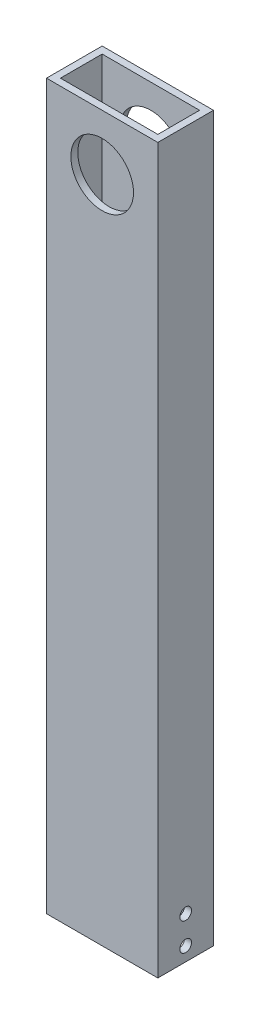
ISO-10303-21;
HEADER;
FILE_DESCRIPTION(('STEP AP214'),'2;1');
FILE_NAME('part.step','',(''),(''),'','','');
FILE_SCHEMA(('AUTOMOTIVE_DESIGN { 1 0 10303 214 1 1 1 1 }'));
ENDSEC;
DATA;
#1=APPLICATION_CONTEXT('core data for automotive mechanical design processes');
#2=APPLICATION_PROTOCOL_DEFINITION('international standard','automotive_design',2000,#1);
#3=PRODUCT_CONTEXT('',#1,'mechanical');
#4=PRODUCT('Part','Part','',(#3));
#5=PRODUCT_RELATED_PRODUCT_CATEGORY('part','',(#4));
#6=PRODUCT_DEFINITION_FORMATION('','',#4);
#7=PRODUCT_DEFINITION_CONTEXT('part definition',#1,'design');
#8=PRODUCT_DEFINITION('design','',#6,#7);
#9=PRODUCT_DEFINITION_SHAPE('','',#8);
#10=(LENGTH_UNIT() NAMED_UNIT(*) SI_UNIT(.MILLI.,.METRE.));
#11=(NAMED_UNIT(*) PLANE_ANGLE_UNIT() SI_UNIT($,.RADIAN.));
#12=(NAMED_UNIT(*) SI_UNIT($,.STERADIAN.) SOLID_ANGLE_UNIT());
#13=UNCERTAINTY_MEASURE_WITH_UNIT(LENGTH_MEASURE(1.E-05),#10,'distance_accuracy_value','');
#14=(GEOMETRIC_REPRESENTATION_CONTEXT(3) GLOBAL_UNCERTAINTY_ASSIGNED_CONTEXT((#13)) GLOBAL_UNIT_ASSIGNED_CONTEXT((#10,
#11,#12)) REPRESENTATION_CONTEXT('',''));
#15=CARTESIAN_POINT('',(0.,0.,0.));
#16=DIRECTION('',(0.,0.,1.));
#17=DIRECTION('',(1.,0.,0.));
#18=AXIS2_PLACEMENT_3D('',#15,#16,#17);
#19=CARTESIAN_POINT('',(0.,330.2,0.));
#20=DIRECTION('',(0.,-1.,0.));
#21=DIRECTION('',(0.,0.,-1.));
#22=AXIS2_PLACEMENT_3D('',#19,#20,#21);
#23=PLANE('',#22);
#24=DIRECTION('',(0.,0.,1.));
#25=VECTOR('',#24,1.);
#26=CARTESIAN_POINT('',(0.,330.2,0.));
#27=LINE('',#26,#25);
#28=CARTESIAN_POINT('',(0.,330.2,-25.4));
#29=VERTEX_POINT('',#28);
#30=CARTESIAN_POINT('',(0.,330.2,0.));
#31=VERTEX_POINT('',#30);
#32=EDGE_CURVE('E156',#29,#31,#27,.T.);
#33=ORIENTED_EDGE('',*,*,#32,.T.);
#34=DIRECTION('',(1.,0.,0.));
#35=VECTOR('',#34,1.);
#36=CARTESIAN_POINT('',(0.,330.2,0.));
#37=LINE('',#36,#35);
#38=CARTESIAN_POINT('',(50.8,330.2,0.));
#39=VERTEX_POINT('',#38);
#40=EDGE_CURVE('E160',#31,#39,#37,.T.);
#41=ORIENTED_EDGE('',*,*,#40,.T.);
#42=DIRECTION('',(0.,0.,-1.));
#43=VECTOR('',#42,1.);
#44=CARTESIAN_POINT('',(50.8,330.2,0.));
#45=LINE('',#44,#43);
#46=CARTESIAN_POINT('',(50.8,330.2,-25.4));
#47=VERTEX_POINT('',#46);
#48=EDGE_CURVE('E164',#39,#47,#45,.T.);
#49=ORIENTED_EDGE('',*,*,#48,.T.);
#50=DIRECTION('',(-1.,0.,0.));
#51=VECTOR('',#50,1.);
#52=CARTESIAN_POINT('',(0.,330.2,-25.4));
#53=LINE('',#52,#51);
#54=EDGE_CURVE('E167',#47,#29,#53,.T.);
#55=ORIENTED_EDGE('',*,*,#54,.T.);
#56=EDGE_LOOP('',(#33,#41,#49,#55));
#57=FACE_BOUND('',#56,.T.);
#58=DIRECTION('',(0.,0.,1.));
#59=VECTOR('',#58,1.);
#60=CARTESIAN_POINT('',(3.175,330.2,-3.175));
#61=LINE('',#60,#59);
#62=CARTESIAN_POINT('',(3.175,330.2,-22.225));
#63=VERTEX_POINT('',#62);
#64=CARTESIAN_POINT('',(3.175,330.2,-3.175));
#65=VERTEX_POINT('',#64);
#66=EDGE_CURVE('E106',#63,#65,#61,.T.);
#67=ORIENTED_EDGE('',*,*,#66,.F.);
#68=DIRECTION('',(-1.,0.,0.));
#69=VECTOR('',#68,1.);
#70=CARTESIAN_POINT('',(3.175,330.2,-22.225));
#71=LINE('',#70,#69);
#72=CARTESIAN_POINT('',(47.625,330.2,-22.225));
#73=VERTEX_POINT('',#72);
#74=EDGE_CURVE('E132',#73,#63,#71,.T.);
#75=ORIENTED_EDGE('',*,*,#74,.F.);
#76=DIRECTION('',(0.,0.,-1.));
#77=VECTOR('',#76,1.);
#78=CARTESIAN_POINT('',(47.625,330.2,-3.175));
#79=LINE('',#78,#77);
#80=CARTESIAN_POINT('',(47.625,330.2,-3.175));
#81=VERTEX_POINT('',#80);
#82=EDGE_CURVE('E128',#81,#73,#79,.T.);
#83=ORIENTED_EDGE('',*,*,#82,.F.);
#84=DIRECTION('',(1.,0.,0.));
#85=VECTOR('',#84,1.);
#86=CARTESIAN_POINT('',(3.175,330.2,-3.175));
#87=LINE('',#86,#85);
#88=EDGE_CURVE('E115',#65,#81,#87,.T.);
#89=ORIENTED_EDGE('',*,*,#88,.F.);
#90=EDGE_LOOP('',(#67,#75,#83,#89));
#91=FACE_BOUND('',#90,.T.);
#92=ADVANCED_FACE('F39',(#57,#91),#23,.F.);
#93=CARTESIAN_POINT('',(0.,0.,0.));
#94=DIRECTION('',(0.,-1.,0.));
#95=DIRECTION('',(0.,0.,-1.));
#96=AXIS2_PLACEMENT_3D('',#93,#94,#95);
#97=PLANE('',#96);
#98=DIRECTION('',(0.,0.,1.));
#99=VECTOR('',#98,1.);
#100=CARTESIAN_POINT('',(0.,0.,0.));
#101=LINE('',#100,#99);
#102=CARTESIAN_POINT('',(0.,0.,-25.4));
#103=VERTEX_POINT('',#102);
#104=CARTESIAN_POINT('',(0.,0.,0.));
#105=VERTEX_POINT('',#104);
#106=EDGE_CURVE('E124',#103,#105,#101,.T.);
#107=ORIENTED_EDGE('',*,*,#106,.F.);
#108=DIRECTION('',(-1.,0.,0.));
#109=VECTOR('',#108,1.);
#110=CARTESIAN_POINT('',(0.,0.,-25.4));
#111=LINE('',#110,#109);
#112=CARTESIAN_POINT('',(50.8,0.,-25.4));
#113=VERTEX_POINT('',#112);
#114=EDGE_CURVE('E161',#113,#103,#111,.T.);
#115=ORIENTED_EDGE('',*,*,#114,.F.);
#116=DIRECTION('',(0.,0.,-1.));
#117=VECTOR('',#116,1.);
#118=CARTESIAN_POINT('',(50.8,0.,0.));
#119=LINE('',#118,#117);
#120=CARTESIAN_POINT('',(50.8,0.,0.));
#121=VERTEX_POINT('',#120);
#122=EDGE_CURVE('E177',#121,#113,#119,.T.);
#123=ORIENTED_EDGE('',*,*,#122,.F.);
#124=DIRECTION('',(1.,0.,0.));
#125=VECTOR('',#124,1.);
#126=CARTESIAN_POINT('',(0.,0.,0.));
#127=LINE('',#126,#125);
#128=EDGE_CURVE('E174',#105,#121,#127,.T.);
#129=ORIENTED_EDGE('',*,*,#128,.F.);
#130=EDGE_LOOP('',(#107,#115,#123,#129));
#131=FACE_BOUND('',#130,.T.);
#132=DIRECTION('',(-1.,0.,0.));
#133=VECTOR('',#132,1.);
#134=CARTESIAN_POINT('',(3.175,0.,-22.225));
#135=LINE('',#134,#133);
#136=CARTESIAN_POINT('',(47.625,0.,-22.225));
#137=VERTEX_POINT('',#136);
#138=CARTESIAN_POINT('',(3.175,0.,-22.225));
#139=VERTEX_POINT('',#138);
#140=EDGE_CURVE('E116',#137,#139,#135,.T.);
#141=ORIENTED_EDGE('',*,*,#140,.T.);
#142=DIRECTION('',(0.,0.,1.));
#143=VECTOR('',#142,1.);
#144=CARTESIAN_POINT('',(3.175,0.,-3.175));
#145=LINE('',#144,#143);
#146=CARTESIAN_POINT('',(3.175,0.,-3.175));
#147=VERTEX_POINT('',#146);
#148=EDGE_CURVE('E64',#139,#147,#145,.T.);
#149=ORIENTED_EDGE('',*,*,#148,.T.);
#150=DIRECTION('',(1.,0.,0.));
#151=VECTOR('',#150,1.);
#152=CARTESIAN_POINT('',(3.175,0.,-3.175));
#153=LINE('',#152,#151);
#154=CARTESIAN_POINT('',(47.625,0.,-3.175));
#155=VERTEX_POINT('',#154);
#156=EDGE_CURVE('E122',#147,#155,#153,.T.);
#157=ORIENTED_EDGE('',*,*,#156,.T.);
#158=DIRECTION('',(0.,0.,-1.));
#159=VECTOR('',#158,1.);
#160=CARTESIAN_POINT('',(47.625,0.,-3.175));
#161=LINE('',#160,#159);
#162=EDGE_CURVE('E143',#155,#137,#161,.T.);
#163=ORIENTED_EDGE('',*,*,#162,.T.);
#164=EDGE_LOOP('',(#141,#149,#157,#163));
#165=FACE_BOUND('',#164,.T.);
#166=ADVANCED_FACE('F201',(#131,#165),#97,.T.);
#167=CARTESIAN_POINT('',(0.,330.2,0.));
#168=DIRECTION('',(1.,0.,0.));
#169=DIRECTION('',(0.,0.,-1.));
#170=AXIS2_PLACEMENT_3D('',#167,#168,#169);
#171=PLANE('',#170);
#172=ORIENTED_EDGE('',*,*,#106,.T.);
#173=DIRECTION('',(0.,-1.,0.));
#174=VECTOR('',#173,1.);
#175=CARTESIAN_POINT('',(0.,330.2,0.));
#176=LINE('',#175,#174);
#177=EDGE_CURVE('E11',#31,#105,#176,.T.);
#178=ORIENTED_EDGE('',*,*,#177,.F.);
#179=ORIENTED_EDGE('',*,*,#32,.F.);
#180=DIRECTION('',(0.,-1.,0.));
#181=VECTOR('',#180,1.);
#182=CARTESIAN_POINT('',(0.,330.2,-25.4));
#183=LINE('',#182,#181);
#184=EDGE_CURVE('E170',#29,#103,#183,.T.);
#185=ORIENTED_EDGE('',*,*,#184,.T.);
#186=EDGE_LOOP('',(#172,#178,#179,#185));
#187=FACE_BOUND('',#186,.T.);
#188=ADVANCED_FACE('F41',(#187),#171,.F.);
#189=CARTESIAN_POINT('',(0.,330.2,0.));
#190=DIRECTION('',(0.,0.,-1.));
#191=DIRECTION('',(-1.,0.,0.));
#192=AXIS2_PLACEMENT_3D('',#189,#190,#191);
#193=PLANE('',#192);
#194=CARTESIAN_POINT('',(25.4,304.8,0.));
#195=DIRECTION('',(0.,0.,1.));
#196=DIRECTION('',(1.,0.,0.));
#197=AXIS2_PLACEMENT_3D('',#194,#195,#196);
#198=CIRCLE('',#197,14.2875);
#199=CARTESIAN_POINT('',(39.6875,304.8,0.));
#200=VERTEX_POINT('',#199);
#201=EDGE_CURVE('E240',#200,#200,#198,.T.);
#202=ORIENTED_EDGE('',*,*,#201,.F.);
#203=EDGE_LOOP('',(#202));
#204=FACE_BOUND('',#203,.T.);
#205=ORIENTED_EDGE('',*,*,#128,.T.);
#206=DIRECTION('',(0.,-1.,0.));
#207=VECTOR('',#206,1.);
#208=CARTESIAN_POINT('',(50.8,330.2,0.));
#209=LINE('',#208,#207);
#210=EDGE_CURVE('E49',#39,#121,#209,.T.);
#211=ORIENTED_EDGE('',*,*,#210,.F.);
#212=ORIENTED_EDGE('',*,*,#40,.F.);
#213=ORIENTED_EDGE('',*,*,#177,.T.);
#214=EDGE_LOOP('',(#205,#211,#212,#213));
#215=FACE_BOUND('',#214,.T.);
#216=ADVANCED_FACE('F211',(#204,#215),#193,.F.);
#217=CARTESIAN_POINT('',(50.8,330.2,0.));
#218=DIRECTION('',(-1.,0.,0.));
#219=DIRECTION('',(0.,0.,1.));
#220=AXIS2_PLACEMENT_3D('',#217,#218,#219);
#221=PLANE('',#220);
#222=CARTESIAN_POINT('',(50.8,19.05,-12.7));
#223=DIRECTION('',(1.,0.,0.));
#224=DIRECTION('',(0.,0.,-1.));
#225=AXIS2_PLACEMENT_3D('',#222,#223,#224);
#226=CIRCLE('',#225,2.667);
#227=CARTESIAN_POINT('',(50.8,19.05,-15.367));
#228=VERTEX_POINT('',#227);
#229=EDGE_CURVE('E284',#228,#228,#226,.T.);
#230=ORIENTED_EDGE('',*,*,#229,.F.);
#231=EDGE_LOOP('',(#230));
#232=FACE_BOUND('',#231,.T.);
#233=CARTESIAN_POINT('',(50.8,6.35,-12.7));
#234=DIRECTION('',(1.,0.,0.));
#235=DIRECTION('',(0.,0.,-1.));
#236=AXIS2_PLACEMENT_3D('',#233,#234,#235);
#237=CIRCLE('',#236,2.667);
#238=CARTESIAN_POINT('',(50.8,6.35,-15.367));
#239=VERTEX_POINT('',#238);
#240=EDGE_CURVE('E293',#239,#239,#237,.T.);
#241=ORIENTED_EDGE('',*,*,#240,.F.);
#242=EDGE_LOOP('',(#241));
#243=FACE_BOUND('',#242,.T.);
#244=ORIENTED_EDGE('',*,*,#122,.T.);
#245=DIRECTION('',(0.,-1.,0.));
#246=VECTOR('',#245,1.);
#247=CARTESIAN_POINT('',(50.8,330.2,-25.4));
#248=LINE('',#247,#246);
#249=EDGE_CURVE('E185',#47,#113,#248,.T.);
#250=ORIENTED_EDGE('',*,*,#249,.F.);
#251=ORIENTED_EDGE('',*,*,#48,.F.);
#252=ORIENTED_EDGE('',*,*,#210,.T.);
#253=EDGE_LOOP('',(#244,#250,#251,#252));
#254=FACE_BOUND('',#253,.T.);
#255=ADVANCED_FACE('F195',(#232,#243,#254),#221,.F.);
#256=CARTESIAN_POINT('',(0.,330.2,-25.4));
#257=DIRECTION('',(0.,0.,1.));
#258=DIRECTION('',(1.,0.,0.));
#259=AXIS2_PLACEMENT_3D('',#256,#257,#258);
#260=PLANE('',#259);
#261=CARTESIAN_POINT('',(25.4,304.8,-25.4));
#262=DIRECTION('',(0.,0.,1.));
#263=DIRECTION('',(1.,0.,0.));
#264=AXIS2_PLACEMENT_3D('',#261,#262,#263);
#265=CIRCLE('',#264,14.2875);
#266=CARTESIAN_POINT('',(39.6875,304.8,-25.4));
#267=VERTEX_POINT('',#266);
#268=EDGE_CURVE('E237',#267,#267,#265,.F.);
#269=ORIENTED_EDGE('',*,*,#268,.F.);
#270=EDGE_LOOP('',(#269));
#271=FACE_BOUND('',#270,.T.);
#272=ORIENTED_EDGE('',*,*,#114,.T.);
#273=ORIENTED_EDGE('',*,*,#184,.F.);
#274=ORIENTED_EDGE('',*,*,#54,.F.);
#275=ORIENTED_EDGE('',*,*,#249,.T.);
#276=EDGE_LOOP('',(#272,#273,#274,#275));
#277=FACE_BOUND('',#276,.T.);
#278=ADVANCED_FACE('F205',(#271,#277),#260,.F.);
#279=CARTESIAN_POINT('',(3.175,330.2,-3.175));
#280=DIRECTION('',(1.,0.,0.));
#281=DIRECTION('',(0.,0.,-1.));
#282=AXIS2_PLACEMENT_3D('',#279,#280,#281);
#283=PLANE('',#282);
#284=ORIENTED_EDGE('',*,*,#148,.F.);
#285=DIRECTION('',(0.,-1.,0.));
#286=VECTOR('',#285,1.);
#287=CARTESIAN_POINT('',(3.175,330.2,-22.225));
#288=LINE('',#287,#286);
#289=EDGE_CURVE('E110',#63,#139,#288,.T.);
#290=ORIENTED_EDGE('',*,*,#289,.F.);
#291=ORIENTED_EDGE('',*,*,#66,.T.);
#292=DIRECTION('',(0.,-1.,0.));
#293=VECTOR('',#292,1.);
#294=CARTESIAN_POINT('',(3.175,330.2,-3.175));
#295=LINE('',#294,#293);
#296=EDGE_CURVE('E109',#65,#147,#295,.T.);
#297=ORIENTED_EDGE('',*,*,#296,.T.);
#298=EDGE_LOOP('',(#284,#290,#291,#297));
#299=FACE_BOUND('',#298,.T.);
#300=ADVANCED_FACE('F108',(#299),#283,.T.);
#301=CARTESIAN_POINT('',(3.175,330.2,-3.175));
#302=DIRECTION('',(0.,0.,-1.));
#303=DIRECTION('',(-1.,0.,0.));
#304=AXIS2_PLACEMENT_3D('',#301,#302,#303);
#305=PLANE('',#304);
#306=CARTESIAN_POINT('',(25.4,304.8,-3.175));
#307=DIRECTION('',(0.,0.,-1.));
#308=DIRECTION('',(-1.,0.,0.));
#309=AXIS2_PLACEMENT_3D('',#306,#307,#308);
#310=CIRCLE('',#309,14.2875);
#311=CARTESIAN_POINT('',(11.1125,304.8,-3.175));
#312=VERTEX_POINT('',#311);
#313=EDGE_CURVE('E140',#312,#312,#310,.T.);
#314=ORIENTED_EDGE('',*,*,#313,.F.);
#315=EDGE_LOOP('',(#314));
#316=FACE_BOUND('',#315,.T.);
#317=ORIENTED_EDGE('',*,*,#156,.F.);
#318=ORIENTED_EDGE('',*,*,#296,.F.);
#319=ORIENTED_EDGE('',*,*,#88,.T.);
#320=DIRECTION('',(0.,-1.,0.));
#321=VECTOR('',#320,1.);
#322=CARTESIAN_POINT('',(47.625,330.2,-3.175));
#323=LINE('',#322,#321);
#324=EDGE_CURVE('E125',#81,#155,#323,.T.);
#325=ORIENTED_EDGE('',*,*,#324,.T.);
#326=EDGE_LOOP('',(#317,#318,#319,#325));
#327=FACE_BOUND('',#326,.T.);
#328=ADVANCED_FACE('F119',(#316,#327),#305,.T.);
#329=CARTESIAN_POINT('',(47.625,330.2,-3.175));
#330=DIRECTION('',(-1.,0.,0.));
#331=DIRECTION('',(0.,0.,1.));
#332=AXIS2_PLACEMENT_3D('',#329,#330,#331);
#333=PLANE('',#332);
#334=CARTESIAN_POINT('',(47.625,19.05,-12.7));
#335=DIRECTION('',(-1.,0.,0.));
#336=DIRECTION('',(0.,0.,1.));
#337=AXIS2_PLACEMENT_3D('',#334,#335,#336);
#338=CIRCLE('',#337,2.667);
#339=CARTESIAN_POINT('',(47.625,19.05,-10.033));
#340=VERTEX_POINT('',#339);
#341=EDGE_CURVE('E246',#340,#340,#338,.F.);
#342=ORIENTED_EDGE('',*,*,#341,.T.);
#343=EDGE_LOOP('',(#342));
#344=FACE_BOUND('',#343,.T.);
#345=CARTESIAN_POINT('',(47.625,6.35,-12.7));
#346=DIRECTION('',(-1.,0.,0.));
#347=DIRECTION('',(0.,0.,1.));
#348=AXIS2_PLACEMENT_3D('',#345,#346,#347);
#349=CIRCLE('',#348,2.667);
#350=CARTESIAN_POINT('',(47.625,6.35,-10.033));
#351=VERTEX_POINT('',#350);
#352=EDGE_CURVE('E290',#351,#351,#349,.F.);
#353=ORIENTED_EDGE('',*,*,#352,.T.);
#354=EDGE_LOOP('',(#353));
#355=FACE_BOUND('',#354,.T.);
#356=ORIENTED_EDGE('',*,*,#162,.F.);
#357=ORIENTED_EDGE('',*,*,#324,.F.);
#358=ORIENTED_EDGE('',*,*,#82,.T.);
#359=DIRECTION('',(0.,-1.,0.));
#360=VECTOR('',#359,1.);
#361=CARTESIAN_POINT('',(47.625,330.2,-22.225));
#362=LINE('',#361,#360);
#363=EDGE_CURVE('E56',#73,#137,#362,.T.);
#364=ORIENTED_EDGE('',*,*,#363,.T.);
#365=EDGE_LOOP('',(#356,#357,#358,#364));
#366=FACE_BOUND('',#365,.T.);
#367=ADVANCED_FACE('F257',(#344,#355,#366),#333,.T.);
#368=CARTESIAN_POINT('',(3.175,330.2,-22.225));
#369=DIRECTION('',(0.,0.,1.));
#370=DIRECTION('',(1.,0.,0.));
#371=AXIS2_PLACEMENT_3D('',#368,#369,#370);
#372=PLANE('',#371);
#373=CARTESIAN_POINT('',(25.4,304.8,-22.225));
#374=DIRECTION('',(0.,0.,1.));
#375=DIRECTION('',(1.,0.,0.));
#376=AXIS2_PLACEMENT_3D('',#373,#374,#375);
#377=CIRCLE('',#376,14.2875);
#378=CARTESIAN_POINT('',(39.6875,304.8,-22.225));
#379=VERTEX_POINT('',#378);
#380=EDGE_CURVE('E43',#379,#379,#377,.T.);
#381=ORIENTED_EDGE('',*,*,#380,.F.);
#382=EDGE_LOOP('',(#381));
#383=FACE_BOUND('',#382,.T.);
#384=ORIENTED_EDGE('',*,*,#140,.F.);
#385=ORIENTED_EDGE('',*,*,#363,.F.);
#386=ORIENTED_EDGE('',*,*,#74,.T.);
#387=ORIENTED_EDGE('',*,*,#289,.T.);
#388=EDGE_LOOP('',(#384,#385,#386,#387));
#389=FACE_BOUND('',#388,.T.);
#390=ADVANCED_FACE('F261',(#383,#389),#372,.T.);
#391=CARTESIAN_POINT('',(25.4,304.8,-65.8111525448112));
#392=DIRECTION('',(0.,0.,1.));
#393=DIRECTION('',(1.,0.,0.));
#394=AXIS2_PLACEMENT_3D('',#391,#392,#393);
#395=CYLINDRICAL_SURFACE('',#394,14.2875);
#396=ORIENTED_EDGE('',*,*,#380,.T.);
#397=EDGE_LOOP('',(#396));
#398=FACE_BOUND('',#397,.T.);
#399=ORIENTED_EDGE('',*,*,#268,.T.);
#400=EDGE_LOOP('',(#399));
#401=FACE_BOUND('',#400,.T.);
#402=ADVANCED_FACE('F267',(#398,#401),#395,.F.);
#403=ORIENTED_EDGE('',*,*,#313,.T.);
#404=EDGE_LOOP('',(#403));
#405=FACE_BOUND('',#404,.T.);
#406=ORIENTED_EDGE('',*,*,#201,.T.);
#407=EDGE_LOOP('',(#406));
#408=FACE_BOUND('',#407,.T.);
#409=ADVANCED_FACE('F253',(#405,#408),#395,.F.);
#410=CARTESIAN_POINT('',(40.0815848583019,6.35,-12.7));
#411=DIRECTION('',(1.,0.,0.));
#412=DIRECTION('',(0.,0.,-1.));
#413=AXIS2_PLACEMENT_3D('',#410,#411,#412);
#414=CYLINDRICAL_SURFACE('',#413,2.667);
#415=ORIENTED_EDGE('',*,*,#240,.T.);
#416=EDGE_LOOP('',(#415));
#417=FACE_BOUND('',#416,.T.);
#418=ORIENTED_EDGE('',*,*,#352,.F.);
#419=EDGE_LOOP('',(#418));
#420=FACE_BOUND('',#419,.T.);
#421=ADVANCED_FACE('F272',(#417,#420),#414,.F.);
#422=CARTESIAN_POINT('',(40.0815848583019,19.05,-12.7));
#423=DIRECTION('',(1.,0.,0.));
#424=DIRECTION('',(0.,0.,-1.));
#425=AXIS2_PLACEMENT_3D('',#422,#423,#424);
#426=CYLINDRICAL_SURFACE('',#425,2.667);
#427=ORIENTED_EDGE('',*,*,#229,.T.);
#428=EDGE_LOOP('',(#427));
#429=FACE_BOUND('',#428,.T.);
#430=ORIENTED_EDGE('',*,*,#341,.F.);
#431=EDGE_LOOP('',(#430));
#432=FACE_BOUND('',#431,.T.);
#433=ADVANCED_FACE('F275',(#429,#432),#426,.F.);
#434=CLOSED_SHELL('',(#92,#166,#188,#216,#255,#278,#300,#328,#367,#390,#402,#409,#421,#433));
#435=MANIFOLD_SOLID_BREP('B2',#434);
#436=ADVANCED_BREP_SHAPE_REPRESENTATION('',(#18,#435),#14);
#437=SHAPE_DEFINITION_REPRESENTATION(#9,#436);
ENDSEC;
END-ISO-10303-21;
